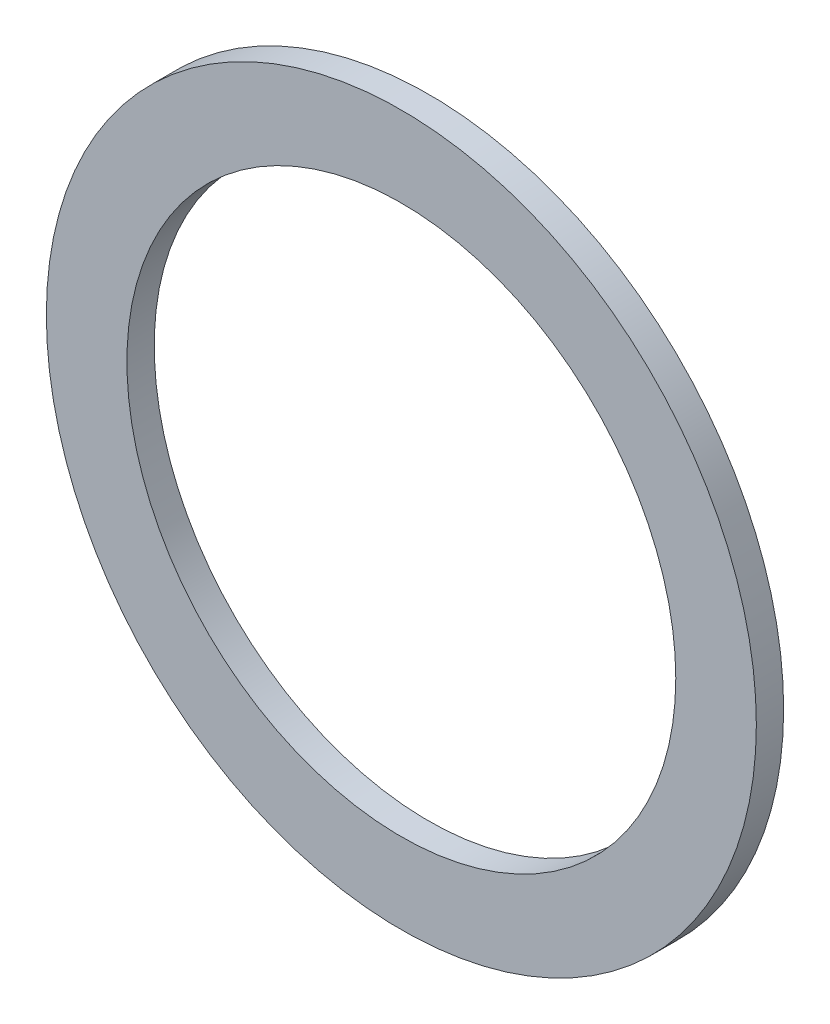
ISO-10303-21;
HEADER;
FILE_DESCRIPTION(('STEP AP214'),'2;1');
FILE_NAME('part.step','',(''),(''),'','','');
FILE_SCHEMA(('AUTOMOTIVE_DESIGN { 1 0 10303 214 1 1 1 1 }'));
ENDSEC;
DATA;
#1=APPLICATION_CONTEXT('core data for automotive mechanical design processes');
#2=APPLICATION_PROTOCOL_DEFINITION('international standard','automotive_design',2000,#1);
#3=PRODUCT_CONTEXT('',#1,'mechanical');
#4=PRODUCT('Part','Part','',(#3));
#5=PRODUCT_RELATED_PRODUCT_CATEGORY('part','',(#4));
#6=PRODUCT_DEFINITION_FORMATION('','',#4);
#7=PRODUCT_DEFINITION_CONTEXT('part definition',#1,'design');
#8=PRODUCT_DEFINITION('design','',#6,#7);
#9=PRODUCT_DEFINITION_SHAPE('','',#8);
#10=(LENGTH_UNIT() NAMED_UNIT(*) SI_UNIT(.MILLI.,.METRE.));
#11=(NAMED_UNIT(*) PLANE_ANGLE_UNIT() SI_UNIT($,.RADIAN.));
#12=(NAMED_UNIT(*) SI_UNIT($,.STERADIAN.) SOLID_ANGLE_UNIT());
#13=UNCERTAINTY_MEASURE_WITH_UNIT(LENGTH_MEASURE(1.E-05),#10,'distance_accuracy_value','');
#14=(GEOMETRIC_REPRESENTATION_CONTEXT(3) GLOBAL_UNCERTAINTY_ASSIGNED_CONTEXT((#13)) GLOBAL_UNIT_ASSIGNED_CONTEXT((#10,
#11,#12)) REPRESENTATION_CONTEXT('',''));
#15=CARTESIAN_POINT('',(0.,0.,0.));
#16=DIRECTION('',(0.,0.,1.));
#17=DIRECTION('',(1.,0.,0.));
#18=AXIS2_PLACEMENT_3D('',#15,#16,#17);
#19=CARTESIAN_POINT('',(0.,0.,0.5));
#20=DIRECTION('',(0.,0.,1.));
#21=DIRECTION('',(1.,0.,0.));
#22=AXIS2_PLACEMENT_3D('',#19,#20,#21);
#23=PLANE('',#22);
#24=CARTESIAN_POINT('',(0.,0.,0.5));
#25=DIRECTION('',(0.,0.,1.));
#26=DIRECTION('',(1.,0.,0.));
#27=AXIS2_PLACEMENT_3D('',#24,#25,#26);
#28=CIRCLE('',#27,6.5);
#29=CARTESIAN_POINT('',(6.5,0.,0.5));
#30=VERTEX_POINT('',#29);
#31=EDGE_CURVE('E10',#30,#30,#28,.T.);
#32=ORIENTED_EDGE('',*,*,#31,.T.);
#33=EDGE_LOOP('',(#32));
#34=FACE_BOUND('',#33,.T.);
#35=CARTESIAN_POINT('',(0.,0.,0.5));
#36=DIRECTION('',(0.,0.,1.));
#37=DIRECTION('',(1.,0.,0.));
#38=AXIS2_PLACEMENT_3D('',#35,#36,#37);
#39=CIRCLE('',#38,5.025);
#40=CARTESIAN_POINT('',(5.025,0.,0.5));
#41=VERTEX_POINT('',#40);
#42=EDGE_CURVE('E50',#41,#41,#39,.T.);
#43=ORIENTED_EDGE('',*,*,#42,.F.);
#44=EDGE_LOOP('',(#43));
#45=FACE_BOUND('',#44,.T.);
#46=ADVANCED_FACE('F39',(#34,#45),#23,.T.);
#47=CARTESIAN_POINT('',(0.,0.,0.));
#48=DIRECTION('',(0.,0.,1.));
#49=DIRECTION('',(1.,0.,0.));
#50=AXIS2_PLACEMENT_3D('',#47,#48,#49);
#51=PLANE('',#50);
#52=CARTESIAN_POINT('',(0.,0.,0.));
#53=DIRECTION('',(0.,0.,1.));
#54=DIRECTION('',(1.,0.,0.));
#55=AXIS2_PLACEMENT_3D('',#52,#53,#54);
#56=CIRCLE('',#55,6.5);
#57=CARTESIAN_POINT('',(6.5,0.,0.));
#58=VERTEX_POINT('',#57);
#59=EDGE_CURVE('E43',#58,#58,#56,.T.);
#60=ORIENTED_EDGE('',*,*,#59,.F.);
#61=EDGE_LOOP('',(#60));
#62=FACE_BOUND('',#61,.T.);
#63=CARTESIAN_POINT('',(0.,0.,0.));
#64=DIRECTION('',(0.,0.,1.));
#65=DIRECTION('',(1.,0.,0.));
#66=AXIS2_PLACEMENT_3D('',#63,#64,#65);
#67=CIRCLE('',#66,5.025);
#68=CARTESIAN_POINT('',(5.025,0.,0.));
#69=VERTEX_POINT('',#68);
#70=EDGE_CURVE('E52',#69,#69,#67,.T.);
#71=ORIENTED_EDGE('',*,*,#70,.T.);
#72=EDGE_LOOP('',(#71));
#73=FACE_BOUND('',#72,.T.);
#74=ADVANCED_FACE('F62',(#62,#73),#51,.F.);
#75=CARTESIAN_POINT('',(0.,0.,0.5));
#76=DIRECTION('',(0.,0.,-1.));
#77=DIRECTION('',(-1.,0.,0.));
#78=AXIS2_PLACEMENT_3D('',#75,#76,#77);
#79=CYLINDRICAL_SURFACE('',#78,6.5);
#80=ORIENTED_EDGE('',*,*,#31,.F.);
#81=EDGE_LOOP('',(#80));
#82=FACE_BOUND('',#81,.T.);
#83=ORIENTED_EDGE('',*,*,#59,.T.);
#84=EDGE_LOOP('',(#83));
#85=FACE_BOUND('',#84,.T.);
#86=ADVANCED_FACE('F41',(#82,#85),#79,.T.);
#87=CARTESIAN_POINT('',(0.,0.,0.5));
#88=DIRECTION('',(0.,0.,-1.));
#89=DIRECTION('',(-1.,0.,0.));
#90=AXIS2_PLACEMENT_3D('',#87,#88,#89);
#91=CYLINDRICAL_SURFACE('',#90,5.025);
#92=ORIENTED_EDGE('',*,*,#42,.T.);
#93=EDGE_LOOP('',(#92));
#94=FACE_BOUND('',#93,.T.);
#95=ORIENTED_EDGE('',*,*,#70,.F.);
#96=EDGE_LOOP('',(#95));
#97=FACE_BOUND('',#96,.T.);
#98=ADVANCED_FACE('F58',(#94,#97),#91,.F.);
#99=CLOSED_SHELL('',(#46,#74,#86,#98));
#100=MANIFOLD_SOLID_BREP('B2',#99);
#101=ADVANCED_BREP_SHAPE_REPRESENTATION('',(#18,#100),#14);
#102=SHAPE_DEFINITION_REPRESENTATION(#9,#101);
ENDSEC;
END-ISO-10303-21;
